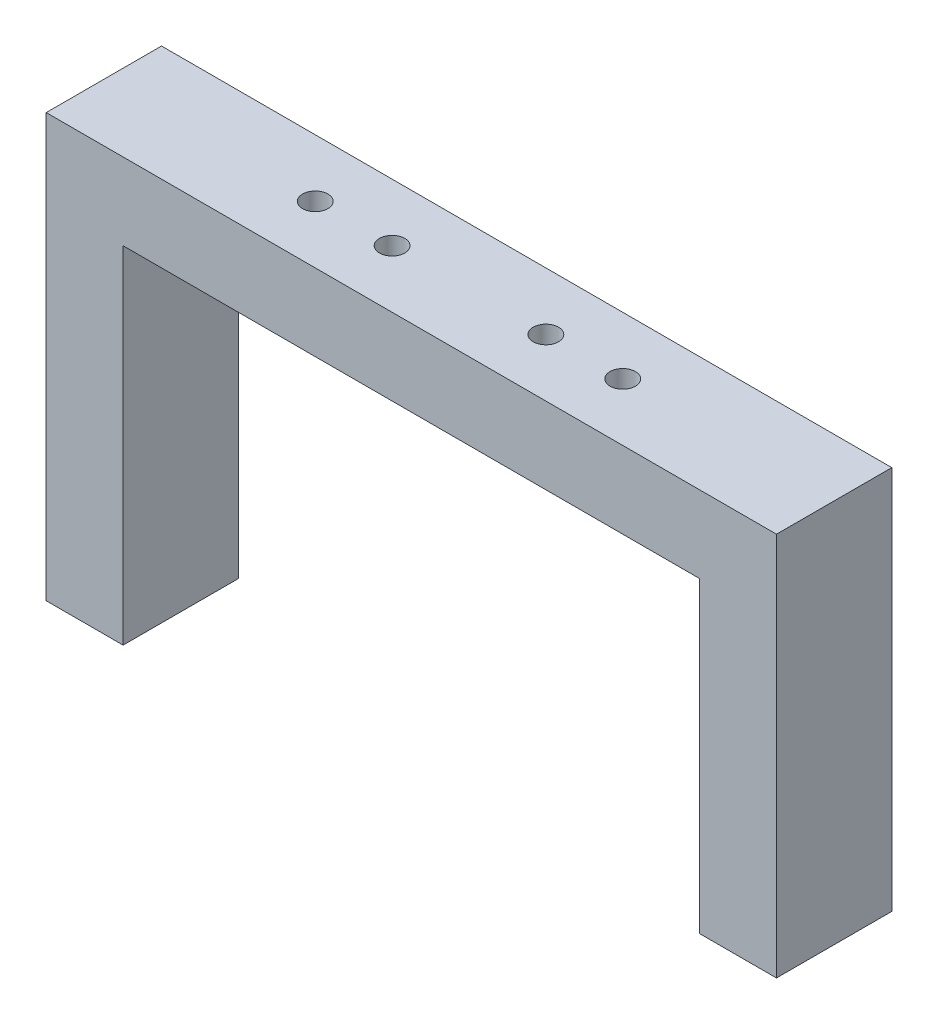
ISO-10303-21;
HEADER;
FILE_DESCRIPTION(('STEP AP214'),'2;1');
FILE_NAME('part.step','',(''),(''),'','','');
FILE_SCHEMA(('AUTOMOTIVE_DESIGN { 1 0 10303 214 1 1 1 1 }'));
ENDSEC;
DATA;
#1=APPLICATION_CONTEXT('core data for automotive mechanical design processes');
#2=APPLICATION_PROTOCOL_DEFINITION('international standard','automotive_design',2000,#1);
#3=PRODUCT_CONTEXT('',#1,'mechanical');
#4=PRODUCT('Part','Part','',(#3));
#5=PRODUCT_RELATED_PRODUCT_CATEGORY('part','',(#4));
#6=PRODUCT_DEFINITION_FORMATION('','',#4);
#7=PRODUCT_DEFINITION_CONTEXT('part definition',#1,'design');
#8=PRODUCT_DEFINITION('design','',#6,#7);
#9=PRODUCT_DEFINITION_SHAPE('','',#8);
#10=(LENGTH_UNIT() NAMED_UNIT(*) SI_UNIT(.MILLI.,.METRE.));
#11=(NAMED_UNIT(*) PLANE_ANGLE_UNIT() SI_UNIT($,.RADIAN.));
#12=(NAMED_UNIT(*) SI_UNIT($,.STERADIAN.) SOLID_ANGLE_UNIT());
#13=UNCERTAINTY_MEASURE_WITH_UNIT(LENGTH_MEASURE(1.E-05),#10,'distance_accuracy_value','');
#14=(GEOMETRIC_REPRESENTATION_CONTEXT(3) GLOBAL_UNCERTAINTY_ASSIGNED_CONTEXT((#13)) GLOBAL_UNIT_ASSIGNED_CONTEXT((#10,
#11,#12)) REPRESENTATION_CONTEXT('',''));
#15=CARTESIAN_POINT('',(0.,0.,0.));
#16=DIRECTION('',(0.,0.,1.));
#17=DIRECTION('',(1.,0.,0.));
#18=AXIS2_PLACEMENT_3D('',#15,#16,#17);
#19=CARTESIAN_POINT('',(-37.5,0.,7.5));
#20=DIRECTION('',(-1.,0.,0.));
#21=DIRECTION('',(0.,-1.,0.));
#22=AXIS2_PLACEMENT_3D('',#19,#20,#21);
#23=PLANE('',#22);
#24=DIRECTION('',(0.,1.,0.));
#25=VECTOR('',#24,1.);
#26=CARTESIAN_POINT('',(-37.5,0.,-7.5));
#27=LINE('',#26,#25);
#28=CARTESIAN_POINT('',(-37.5,-45.,-7.5));
#29=VERTEX_POINT('',#28);
#30=CARTESIAN_POINT('',(-37.5,0.,-7.5));
#31=VERTEX_POINT('',#30);
#32=EDGE_CURVE('E129',#29,#31,#27,.T.);
#33=ORIENTED_EDGE('',*,*,#32,.T.);
#34=DIRECTION('',(0.,0.,-1.));
#35=VECTOR('',#34,1.);
#36=CARTESIAN_POINT('',(-37.5,0.,7.5));
#37=LINE('',#36,#35);
#38=CARTESIAN_POINT('',(-37.5,0.,7.5));
#39=VERTEX_POINT('',#38);
#40=EDGE_CURVE('E11',#39,#31,#37,.T.);
#41=ORIENTED_EDGE('',*,*,#40,.F.);
#42=DIRECTION('',(0.,1.,0.));
#43=VECTOR('',#42,1.);
#44=CARTESIAN_POINT('',(-37.5,0.,7.5));
#45=LINE('',#44,#43);
#46=CARTESIAN_POINT('',(-37.5,-45.,7.5));
#47=VERTEX_POINT('',#46);
#48=EDGE_CURVE('E144',#47,#39,#45,.T.);
#49=ORIENTED_EDGE('',*,*,#48,.F.);
#50=DIRECTION('',(0.,0.,-1.));
#51=VECTOR('',#50,1.);
#52=CARTESIAN_POINT('',(-37.5,-45.,7.5));
#53=LINE('',#52,#51);
#54=EDGE_CURVE('E125',#47,#29,#53,.T.);
#55=ORIENTED_EDGE('',*,*,#54,.T.);
#56=EDGE_LOOP('',(#33,#41,#49,#55));
#57=FACE_BOUND('',#56,.T.);
#58=ADVANCED_FACE('F33',(#57),#23,.F.);
#59=CARTESIAN_POINT('',(-37.5,0.,7.5));
#60=DIRECTION('',(0.,1.,0.));
#61=DIRECTION('',(-1.,0.,0.));
#62=AXIS2_PLACEMENT_3D('',#59,#60,#61);
#63=PLANE('',#62);
#64=CARTESIAN_POINT('',(-20.,0.,0.));
#65=DIRECTION('',(0.,1.,0.));
#66=DIRECTION('',(-1.,0.,0.));
#67=AXIS2_PLACEMENT_3D('',#64,#65,#66);
#68=CIRCLE('',#67,1.65);
#69=CARTESIAN_POINT('',(-21.65,0.,0.));
#70=VERTEX_POINT('',#69);
#71=EDGE_CURVE('E183',#70,#70,#68,.F.);
#72=ORIENTED_EDGE('',*,*,#71,.F.);
#73=EDGE_LOOP('',(#72));
#74=FACE_BOUND('',#73,.T.);
#75=CARTESIAN_POINT('',(20.,0.,0.));
#76=DIRECTION('',(0.,1.,0.));
#77=DIRECTION('',(-1.,0.,0.));
#78=AXIS2_PLACEMENT_3D('',#75,#76,#77);
#79=CIRCLE('',#78,1.65);
#80=CARTESIAN_POINT('',(18.35,0.,0.));
#81=VERTEX_POINT('',#80);
#82=EDGE_CURVE('E190',#81,#81,#79,.F.);
#83=ORIENTED_EDGE('',*,*,#82,.F.);
#84=EDGE_LOOP('',(#83));
#85=FACE_BOUND('',#84,.T.);
#86=CARTESIAN_POINT('',(10.,0.,0.));
#87=DIRECTION('',(0.,1.,0.));
#88=DIRECTION('',(-1.,0.,0.));
#89=AXIS2_PLACEMENT_3D('',#86,#87,#88);
#90=CIRCLE('',#89,1.65);
#91=CARTESIAN_POINT('',(8.35,0.,0.));
#92=VERTEX_POINT('',#91);
#93=EDGE_CURVE('E182',#92,#92,#90,.F.);
#94=ORIENTED_EDGE('',*,*,#93,.F.);
#95=EDGE_LOOP('',(#94));
#96=FACE_BOUND('',#95,.T.);
#97=CARTESIAN_POINT('',(-10.,0.,0.));
#98=DIRECTION('',(0.,1.,0.));
#99=DIRECTION('',(-1.,0.,0.));
#100=AXIS2_PLACEMENT_3D('',#97,#98,#99);
#101=CIRCLE('',#100,1.65);
#102=CARTESIAN_POINT('',(-11.65,0.,0.));
#103=VERTEX_POINT('',#102);
#104=EDGE_CURVE('E133',#103,#103,#101,.F.);
#105=ORIENTED_EDGE('',*,*,#104,.F.);
#106=EDGE_LOOP('',(#105));
#107=FACE_BOUND('',#106,.T.);
#108=DIRECTION('',(1.,0.,0.));
#109=VECTOR('',#108,1.);
#110=CARTESIAN_POINT('',(-37.5,0.,-7.5));
#111=LINE('',#110,#109);
#112=CARTESIAN_POINT('',(37.5,0.,-7.5));
#113=VERTEX_POINT('',#112);
#114=EDGE_CURVE('E132',#31,#113,#111,.T.);
#115=ORIENTED_EDGE('',*,*,#114,.T.);
#116=DIRECTION('',(0.,0.,-1.));
#117=VECTOR('',#116,1.);
#118=CARTESIAN_POINT('',(37.5,0.,7.5));
#119=LINE('',#118,#117);
#120=CARTESIAN_POINT('',(37.5,0.,7.5));
#121=VERTEX_POINT('',#120);
#122=EDGE_CURVE('E41',#121,#113,#119,.T.);
#123=ORIENTED_EDGE('',*,*,#122,.F.);
#124=DIRECTION('',(1.,0.,0.));
#125=VECTOR('',#124,1.);
#126=CARTESIAN_POINT('',(-37.5,0.,7.5));
#127=LINE('',#126,#125);
#128=EDGE_CURVE('E92',#39,#121,#127,.T.);
#129=ORIENTED_EDGE('',*,*,#128,.F.);
#130=ORIENTED_EDGE('',*,*,#40,.T.);
#131=EDGE_LOOP('',(#115,#123,#129,#130));
#132=FACE_BOUND('',#131,.T.);
#133=ADVANCED_FACE('F216',(#74,#85,#96,#107,#132),#63,.F.);
#134=CARTESIAN_POINT('',(37.5,0.,7.5));
#135=DIRECTION('',(1.,0.,0.));
#136=DIRECTION('',(0.,1.,0.));
#137=AXIS2_PLACEMENT_3D('',#134,#135,#136);
#138=PLANE('',#137);
#139=DIRECTION('',(0.,-1.,0.));
#140=VECTOR('',#139,1.);
#141=CARTESIAN_POINT('',(37.5,0.,-7.5));
#142=LINE('',#141,#140);
#143=CARTESIAN_POINT('',(37.5,-40.,-7.5));
#144=VERTEX_POINT('',#143);
#145=EDGE_CURVE('E135',#113,#144,#142,.T.);
#146=ORIENTED_EDGE('',*,*,#145,.T.);
#147=DIRECTION('',(0.,0.,-1.));
#148=VECTOR('',#147,1.);
#149=CARTESIAN_POINT('',(37.5,-40.,7.5));
#150=LINE('',#149,#148);
#151=CARTESIAN_POINT('',(37.5,-40.,7.5));
#152=VERTEX_POINT('',#151);
#153=EDGE_CURVE('E151',#152,#144,#150,.T.);
#154=ORIENTED_EDGE('',*,*,#153,.F.);
#155=DIRECTION('',(0.,-1.,0.));
#156=VECTOR('',#155,1.);
#157=CARTESIAN_POINT('',(37.5,0.,7.5));
#158=LINE('',#157,#156);
#159=EDGE_CURVE('E159',#121,#152,#158,.T.);
#160=ORIENTED_EDGE('',*,*,#159,.F.);
#161=ORIENTED_EDGE('',*,*,#122,.T.);
#162=EDGE_LOOP('',(#146,#154,#160,#161));
#163=FACE_BOUND('',#162,.T.);
#164=ADVANCED_FACE('F157',(#163),#138,.F.);
#165=CARTESIAN_POINT('',(37.5,-40.,7.5));
#166=DIRECTION('',(0.,1.,0.));
#167=DIRECTION('',(0.,0.,1.));
#168=AXIS2_PLACEMENT_3D('',#165,#166,#167);
#169=PLANE('',#168);
#170=DIRECTION('',(1.,0.,0.));
#171=VECTOR('',#170,1.);
#172=CARTESIAN_POINT('',(37.5,-40.,-7.5));
#173=LINE('',#172,#171);
#174=CARTESIAN_POINT('',(47.5,-40.,-7.5));
#175=VERTEX_POINT('',#174);
#176=EDGE_CURVE('E137',#144,#175,#173,.T.);
#177=ORIENTED_EDGE('',*,*,#176,.T.);
#178=DIRECTION('',(0.,0.,-1.));
#179=VECTOR('',#178,1.);
#180=CARTESIAN_POINT('',(47.5,-40.,7.5));
#181=LINE('',#180,#179);
#182=CARTESIAN_POINT('',(47.5,-40.,7.5));
#183=VERTEX_POINT('',#182);
#184=EDGE_CURVE('E148',#183,#175,#181,.T.);
#185=ORIENTED_EDGE('',*,*,#184,.F.);
#186=DIRECTION('',(1.,0.,0.));
#187=VECTOR('',#186,1.);
#188=CARTESIAN_POINT('',(37.5,-40.,7.5));
#189=LINE('',#188,#187);
#190=EDGE_CURVE('E171',#152,#183,#189,.T.);
#191=ORIENTED_EDGE('',*,*,#190,.F.);
#192=ORIENTED_EDGE('',*,*,#153,.T.);
#193=EDGE_LOOP('',(#177,#185,#191,#192));
#194=FACE_BOUND('',#193,.T.);
#195=ADVANCED_FACE('F167',(#194),#169,.F.);
#196=CARTESIAN_POINT('',(47.5,10.,7.5));
#197=DIRECTION('',(-1.,0.,0.));
#198=DIRECTION('',(0.,-1.,0.));
#199=AXIS2_PLACEMENT_3D('',#196,#197,#198);
#200=PLANE('',#199);
#201=DIRECTION('',(0.,1.,0.));
#202=VECTOR('',#201,1.);
#203=CARTESIAN_POINT('',(47.5,10.,-7.5));
#204=LINE('',#203,#202);
#205=CARTESIAN_POINT('',(47.5,10.,-7.5));
#206=VERTEX_POINT('',#205);
#207=EDGE_CURVE('E139',#175,#206,#204,.T.);
#208=ORIENTED_EDGE('',*,*,#207,.T.);
#209=DIRECTION('',(0.,0.,-1.));
#210=VECTOR('',#209,1.);
#211=CARTESIAN_POINT('',(47.5,10.,7.5));
#212=LINE('',#211,#210);
#213=CARTESIAN_POINT('',(47.5,10.,7.5));
#214=VERTEX_POINT('',#213);
#215=EDGE_CURVE('E120',#214,#206,#212,.T.);
#216=ORIENTED_EDGE('',*,*,#215,.F.);
#217=DIRECTION('',(0.,1.,0.));
#218=VECTOR('',#217,1.);
#219=CARTESIAN_POINT('',(47.5,10.,7.5));
#220=LINE('',#219,#218);
#221=EDGE_CURVE('E111',#183,#214,#220,.T.);
#222=ORIENTED_EDGE('',*,*,#221,.F.);
#223=ORIENTED_EDGE('',*,*,#184,.T.);
#224=EDGE_LOOP('',(#208,#216,#222,#223));
#225=FACE_BOUND('',#224,.T.);
#226=ADVANCED_FACE('F170',(#225),#200,.F.);
#227=CARTESIAN_POINT('',(-47.5,10.,7.5));
#228=DIRECTION('',(0.,-1.,0.));
#229=DIRECTION('',(0.,0.,-1.));
#230=AXIS2_PLACEMENT_3D('',#227,#228,#229);
#231=PLANE('',#230);
#232=CARTESIAN_POINT('',(-20.,10.,0.));
#233=DIRECTION('',(0.,1.,0.));
#234=DIRECTION('',(0.,0.,1.));
#235=AXIS2_PLACEMENT_3D('',#232,#233,#234);
#236=CIRCLE('',#235,1.65);
#237=CARTESIAN_POINT('',(-20.,10.,1.65));
#238=VERTEX_POINT('',#237);
#239=EDGE_CURVE('E187',#238,#238,#236,.T.);
#240=ORIENTED_EDGE('',*,*,#239,.F.);
#241=EDGE_LOOP('',(#240));
#242=FACE_BOUND('',#241,.T.);
#243=CARTESIAN_POINT('',(20.,10.,0.));
#244=DIRECTION('',(0.,1.,0.));
#245=DIRECTION('',(0.,0.,1.));
#246=AXIS2_PLACEMENT_3D('',#243,#244,#245);
#247=CIRCLE('',#246,1.65);
#248=CARTESIAN_POINT('',(20.,10.,1.65));
#249=VERTEX_POINT('',#248);
#250=EDGE_CURVE('E186',#249,#249,#247,.T.);
#251=ORIENTED_EDGE('',*,*,#250,.F.);
#252=EDGE_LOOP('',(#251));
#253=FACE_BOUND('',#252,.T.);
#254=CARTESIAN_POINT('',(10.,10.,0.));
#255=DIRECTION('',(0.,1.,0.));
#256=DIRECTION('',(0.,0.,1.));
#257=AXIS2_PLACEMENT_3D('',#254,#255,#256);
#258=CIRCLE('',#257,1.65);
#259=CARTESIAN_POINT('',(10.,10.,1.65));
#260=VERTEX_POINT('',#259);
#261=EDGE_CURVE('E193',#260,#260,#258,.T.);
#262=ORIENTED_EDGE('',*,*,#261,.F.);
#263=EDGE_LOOP('',(#262));
#264=FACE_BOUND('',#263,.T.);
#265=CARTESIAN_POINT('',(-10.,10.,0.));
#266=DIRECTION('',(0.,1.,0.));
#267=DIRECTION('',(0.,0.,1.));
#268=AXIS2_PLACEMENT_3D('',#265,#266,#267);
#269=CIRCLE('',#268,1.65);
#270=CARTESIAN_POINT('',(-10.,10.,1.65));
#271=VERTEX_POINT('',#270);
#272=EDGE_CURVE('E179',#271,#271,#269,.T.);
#273=ORIENTED_EDGE('',*,*,#272,.F.);
#274=EDGE_LOOP('',(#273));
#275=FACE_BOUND('',#274,.T.);
#276=DIRECTION('',(-1.,0.,0.));
#277=VECTOR('',#276,1.);
#278=CARTESIAN_POINT('',(-47.5,10.,-7.5));
#279=LINE('',#278,#277);
#280=CARTESIAN_POINT('',(-47.5,10.,-7.5));
#281=VERTEX_POINT('',#280);
#282=EDGE_CURVE('E119',#206,#281,#279,.T.);
#283=ORIENTED_EDGE('',*,*,#282,.T.);
#284=DIRECTION('',(0.,0.,-1.));
#285=VECTOR('',#284,1.);
#286=CARTESIAN_POINT('',(-47.5,10.,7.5));
#287=LINE('',#286,#285);
#288=CARTESIAN_POINT('',(-47.5,10.,7.5));
#289=VERTEX_POINT('',#288);
#290=EDGE_CURVE('E116',#289,#281,#287,.T.);
#291=ORIENTED_EDGE('',*,*,#290,.F.);
#292=DIRECTION('',(-1.,0.,0.));
#293=VECTOR('',#292,1.);
#294=CARTESIAN_POINT('',(-47.5,10.,7.5));
#295=LINE('',#294,#293);
#296=EDGE_CURVE('E105',#214,#289,#295,.T.);
#297=ORIENTED_EDGE('',*,*,#296,.F.);
#298=ORIENTED_EDGE('',*,*,#215,.T.);
#299=EDGE_LOOP('',(#283,#291,#297,#298));
#300=FACE_BOUND('',#299,.T.);
#301=ADVANCED_FACE('F117',(#242,#253,#264,#275,#300),#231,.F.);
#302=CARTESIAN_POINT('',(-47.5,10.,7.5));
#303=DIRECTION('',(1.,0.,0.));
#304=DIRECTION('',(0.,1.,0.));
#305=AXIS2_PLACEMENT_3D('',#302,#303,#304);
#306=PLANE('',#305);
#307=DIRECTION('',(0.,-1.,0.));
#308=VECTOR('',#307,1.);
#309=CARTESIAN_POINT('',(-47.5,10.,-7.5));
#310=LINE('',#309,#308);
#311=CARTESIAN_POINT('',(-47.5,-45.,-7.5));
#312=VERTEX_POINT('',#311);
#313=EDGE_CURVE('E78',#281,#312,#310,.T.);
#314=ORIENTED_EDGE('',*,*,#313,.T.);
#315=DIRECTION('',(0.,0.,-1.));
#316=VECTOR('',#315,1.);
#317=CARTESIAN_POINT('',(-47.5,-45.,7.5));
#318=LINE('',#317,#316);
#319=CARTESIAN_POINT('',(-47.5,-45.,7.5));
#320=VERTEX_POINT('',#319);
#321=EDGE_CURVE('E121',#320,#312,#318,.T.);
#322=ORIENTED_EDGE('',*,*,#321,.F.);
#323=DIRECTION('',(0.,-1.,0.));
#324=VECTOR('',#323,1.);
#325=CARTESIAN_POINT('',(-47.5,10.,7.5));
#326=LINE('',#325,#324);
#327=EDGE_CURVE('E109',#289,#320,#326,.T.);
#328=ORIENTED_EDGE('',*,*,#327,.F.);
#329=ORIENTED_EDGE('',*,*,#290,.T.);
#330=EDGE_LOOP('',(#314,#322,#328,#329));
#331=FACE_BOUND('',#330,.T.);
#332=ADVANCED_FACE('F123',(#331),#306,.F.);
#333=CARTESIAN_POINT('',(-37.5,-45.,7.5));
#334=DIRECTION('',(0.,1.,0.));
#335=DIRECTION('',(0.,0.,1.));
#336=AXIS2_PLACEMENT_3D('',#333,#334,#335);
#337=PLANE('',#336);
#338=DIRECTION('',(1.,0.,0.));
#339=VECTOR('',#338,1.);
#340=CARTESIAN_POINT('',(-37.5,-45.,-7.5));
#341=LINE('',#340,#339);
#342=EDGE_CURVE('E84',#312,#29,#341,.T.);
#343=ORIENTED_EDGE('',*,*,#342,.T.);
#344=ORIENTED_EDGE('',*,*,#54,.F.);
#345=DIRECTION('',(1.,0.,0.));
#346=VECTOR('',#345,1.);
#347=CARTESIAN_POINT('',(-37.5,-45.,7.5));
#348=LINE('',#347,#346);
#349=EDGE_CURVE('E49',#320,#47,#348,.T.);
#350=ORIENTED_EDGE('',*,*,#349,.F.);
#351=ORIENTED_EDGE('',*,*,#321,.T.);
#352=EDGE_LOOP('',(#343,#344,#350,#351));
#353=FACE_BOUND('',#352,.T.);
#354=ADVANCED_FACE('F222',(#353),#337,.F.);
#355=CARTESIAN_POINT('',(0.,0.,7.5));
#356=DIRECTION('',(0.,0.,-1.));
#357=DIRECTION('',(-1.,0.,0.));
#358=AXIS2_PLACEMENT_3D('',#355,#356,#357);
#359=PLANE('',#358);
#360=ORIENTED_EDGE('',*,*,#48,.T.);
#361=ORIENTED_EDGE('',*,*,#128,.T.);
#362=ORIENTED_EDGE('',*,*,#159,.T.);
#363=ORIENTED_EDGE('',*,*,#190,.T.);
#364=ORIENTED_EDGE('',*,*,#221,.T.);
#365=ORIENTED_EDGE('',*,*,#296,.T.);
#366=ORIENTED_EDGE('',*,*,#327,.T.);
#367=ORIENTED_EDGE('',*,*,#349,.T.);
#368=EDGE_LOOP('',(#360,#361,#362,#363,#364,#365,#366,#367));
#369=FACE_BOUND('',#368,.T.);
#370=ADVANCED_FACE('F107',(#369),#359,.F.);
#371=CARTESIAN_POINT('',(0.,0.,-7.5));
#372=DIRECTION('',(0.,0.,-1.));
#373=DIRECTION('',(-1.,0.,0.));
#374=AXIS2_PLACEMENT_3D('',#371,#372,#373);
#375=PLANE('',#374);
#376=ORIENTED_EDGE('',*,*,#32,.F.);
#377=ORIENTED_EDGE('',*,*,#342,.F.);
#378=ORIENTED_EDGE('',*,*,#313,.F.);
#379=ORIENTED_EDGE('',*,*,#282,.F.);
#380=ORIENTED_EDGE('',*,*,#207,.F.);
#381=ORIENTED_EDGE('',*,*,#176,.F.);
#382=ORIENTED_EDGE('',*,*,#145,.F.);
#383=ORIENTED_EDGE('',*,*,#114,.F.);
#384=EDGE_LOOP('',(#376,#377,#378,#379,#380,#381,#382,#383));
#385=FACE_BOUND('',#384,.T.);
#386=ADVANCED_FACE('F163',(#385),#375,.T.);
#387=CARTESIAN_POINT('',(-10.,-45.001,0.));
#388=DIRECTION('',(0.,1.,0.));
#389=DIRECTION('',(0.,0.,1.));
#390=AXIS2_PLACEMENT_3D('',#387,#388,#389);
#391=CYLINDRICAL_SURFACE('',#390,1.65);
#392=ORIENTED_EDGE('',*,*,#272,.T.);
#393=EDGE_LOOP('',(#392));
#394=FACE_BOUND('',#393,.T.);
#395=ORIENTED_EDGE('',*,*,#104,.T.);
#396=EDGE_LOOP('',(#395));
#397=FACE_BOUND('',#396,.T.);
#398=ADVANCED_FACE('F210',(#394,#397),#391,.F.);
#399=CARTESIAN_POINT('',(10.,-45.001,0.));
#400=DIRECTION('',(0.,1.,0.));
#401=DIRECTION('',(0.,0.,1.));
#402=AXIS2_PLACEMENT_3D('',#399,#400,#401);
#403=CYLINDRICAL_SURFACE('',#402,1.65);
#404=ORIENTED_EDGE('',*,*,#261,.T.);
#405=EDGE_LOOP('',(#404));
#406=FACE_BOUND('',#405,.T.);
#407=ORIENTED_EDGE('',*,*,#93,.T.);
#408=EDGE_LOOP('',(#407));
#409=FACE_BOUND('',#408,.T.);
#410=ADVANCED_FACE('F201',(#406,#409),#403,.F.);
#411=CARTESIAN_POINT('',(20.,-45.001,0.));
#412=DIRECTION('',(0.,1.,0.));
#413=DIRECTION('',(0.,0.,1.));
#414=AXIS2_PLACEMENT_3D('',#411,#412,#413);
#415=CYLINDRICAL_SURFACE('',#414,1.65);
#416=ORIENTED_EDGE('',*,*,#250,.T.);
#417=EDGE_LOOP('',(#416));
#418=FACE_BOUND('',#417,.T.);
#419=ORIENTED_EDGE('',*,*,#82,.T.);
#420=EDGE_LOOP('',(#419));
#421=FACE_BOUND('',#420,.T.);
#422=ADVANCED_FACE('F294',(#418,#421),#415,.F.);
#423=CARTESIAN_POINT('',(-20.,-45.001,0.));
#424=DIRECTION('',(0.,1.,0.));
#425=DIRECTION('',(0.,0.,1.));
#426=AXIS2_PLACEMENT_3D('',#423,#424,#425);
#427=CYLINDRICAL_SURFACE('',#426,1.65);
#428=ORIENTED_EDGE('',*,*,#239,.T.);
#429=EDGE_LOOP('',(#428));
#430=FACE_BOUND('',#429,.T.);
#431=ORIENTED_EDGE('',*,*,#71,.T.);
#432=EDGE_LOOP('',(#431));
#433=FACE_BOUND('',#432,.T.);
#434=ADVANCED_FACE('F301',(#430,#433),#427,.F.);
#435=CLOSED_SHELL('',(#58,#133,#164,#195,#226,#301,#332,#354,#370,#386,#398,#410,#422,#434));
#436=MANIFOLD_SOLID_BREP('B2',#435);
#437=ADVANCED_BREP_SHAPE_REPRESENTATION('',(#18,#436),#14);
#438=SHAPE_DEFINITION_REPRESENTATION(#9,#437);
ENDSEC;
END-ISO-10303-21;
